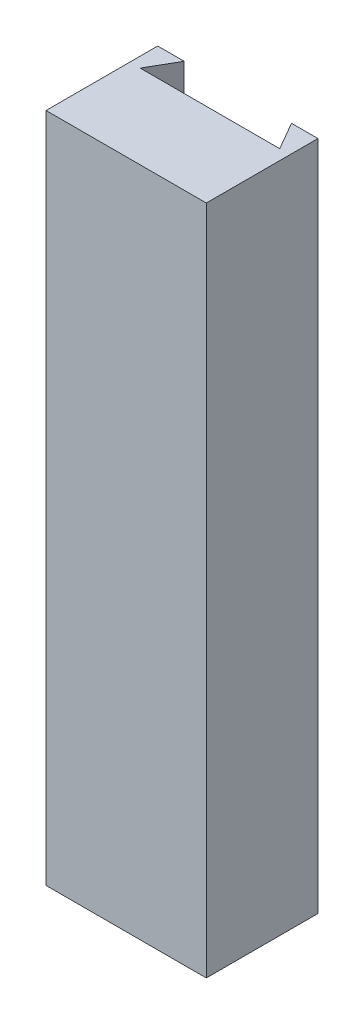
ISO-10303-21;
HEADER;
FILE_DESCRIPTION(('STEP AP214'),'2;1');
FILE_NAME('part.step','',(''),(''),'','','');
FILE_SCHEMA(('AUTOMOTIVE_DESIGN { 1 0 10303 214 1 1 1 1 }'));
ENDSEC;
DATA;
#1=APPLICATION_CONTEXT('core data for automotive mechanical design processes');
#2=APPLICATION_PROTOCOL_DEFINITION('international standard','automotive_design',2000,#1);
#3=PRODUCT_CONTEXT('',#1,'mechanical');
#4=PRODUCT('Part','Part','',(#3));
#5=PRODUCT_RELATED_PRODUCT_CATEGORY('part','',(#4));
#6=PRODUCT_DEFINITION_FORMATION('','',#4);
#7=PRODUCT_DEFINITION_CONTEXT('part definition',#1,'design');
#8=PRODUCT_DEFINITION('design','',#6,#7);
#9=PRODUCT_DEFINITION_SHAPE('','',#8);
#10=(LENGTH_UNIT() NAMED_UNIT(*) SI_UNIT(.MILLI.,.METRE.));
#11=(NAMED_UNIT(*) PLANE_ANGLE_UNIT() SI_UNIT($,.RADIAN.));
#12=(NAMED_UNIT(*) SI_UNIT($,.STERADIAN.) SOLID_ANGLE_UNIT());
#13=UNCERTAINTY_MEASURE_WITH_UNIT(LENGTH_MEASURE(1.E-05),#10,'distance_accuracy_value','');
#14=(GEOMETRIC_REPRESENTATION_CONTEXT(3) GLOBAL_UNCERTAINTY_ASSIGNED_CONTEXT((#13)) GLOBAL_UNIT_ASSIGNED_CONTEXT((#10,
#11,#12)) REPRESENTATION_CONTEXT('',''));
#15=CARTESIAN_POINT('',(0.,0.,0.));
#16=DIRECTION('',(0.,0.,1.));
#17=DIRECTION('',(1.,0.,0.));
#18=AXIS2_PLACEMENT_3D('',#15,#16,#17);
#19=CARTESIAN_POINT('',(0.,0.,0.));
#20=DIRECTION('',(0.,0.,-1.));
#21=DIRECTION('',(-1.,0.,0.));
#22=AXIS2_PLACEMENT_3D('',#19,#20,#21);
#23=PLANE('',#22);
#24=DIRECTION('',(0.,-1.,0.));
#25=VECTOR('',#24,1.);
#26=CARTESIAN_POINT('',(-0.961324865405189,12.021,0.));
#27=LINE('',#26,#25);
#28=CARTESIAN_POINT('',(-0.961324865405188,12.02,0.));
#29=VERTEX_POINT('',#28);
#30=CARTESIAN_POINT('',(-0.961324865405187,0.,0.));
#31=VERTEX_POINT('',#30);
#32=EDGE_CURVE('E110',#29,#31,#27,.T.);
#33=ORIENTED_EDGE('',*,*,#32,.T.);
#34=DIRECTION('',(1.,0.,0.));
#35=VECTOR('',#34,1.);
#36=CARTESIAN_POINT('',(-1.43499999999999,0.,0.));
#37=LINE('',#36,#35);
#38=CARTESIAN_POINT('',(-1.43499999999999,0.,0.));
#39=VERTEX_POINT('',#38);
#40=EDGE_CURVE('E124',#39,#31,#37,.T.);
#41=ORIENTED_EDGE('',*,*,#40,.F.);
#42=DIRECTION('',(0.,-1.,0.));
#43=VECTOR('',#42,1.);
#44=CARTESIAN_POINT('',(-1.43499999999999,0.,0.));
#45=LINE('',#44,#43);
#46=CARTESIAN_POINT('',(-1.435,12.02,0.));
#47=VERTEX_POINT('',#46);
#48=EDGE_CURVE('E136',#47,#39,#45,.T.);
#49=ORIENTED_EDGE('',*,*,#48,.F.);
#50=DIRECTION('',(-1.,0.,0.));
#51=VECTOR('',#50,1.);
#52=CARTESIAN_POINT('',(-1.435,12.02,0.));
#53=LINE('',#52,#51);
#54=EDGE_CURVE('E125',#29,#47,#53,.T.);
#55=ORIENTED_EDGE('',*,*,#54,.F.);
#56=EDGE_LOOP('',(#33,#41,#49,#55));
#57=FACE_BOUND('',#56,.T.);
#58=ADVANCED_FACE('F33',(#57),#23,.T.);
#59=CARTESIAN_POINT('',(1.43499999999999,0.,2.));
#60=DIRECTION('',(-1.,0.,0.));
#61=DIRECTION('',(0.,-1.,0.));
#62=AXIS2_PLACEMENT_3D('',#59,#60,#61);
#63=PLANE('',#62);
#64=DIRECTION('',(0.,1.,0.));
#65=VECTOR('',#64,1.);
#66=CARTESIAN_POINT('',(1.43499999999999,0.,0.));
#67=LINE('',#66,#65);
#68=CARTESIAN_POINT('',(1.43499999999999,0.,0.));
#69=VERTEX_POINT('',#68);
#70=CARTESIAN_POINT('',(1.435,12.02,0.));
#71=VERTEX_POINT('',#70);
#72=EDGE_CURVE('E149',#69,#71,#67,.T.);
#73=ORIENTED_EDGE('',*,*,#72,.T.);
#74=DIRECTION('',(0.,0.,-1.));
#75=VECTOR('',#74,1.);
#76=CARTESIAN_POINT('',(1.435,12.02,2.));
#77=LINE('',#76,#75);
#78=CARTESIAN_POINT('',(1.435,12.02,2.));
#79=VERTEX_POINT('',#78);
#80=EDGE_CURVE('E11',#79,#71,#77,.T.);
#81=ORIENTED_EDGE('',*,*,#80,.F.);
#82=DIRECTION('',(0.,1.,0.));
#83=VECTOR('',#82,1.);
#84=CARTESIAN_POINT('',(1.43499999999999,0.,2.));
#85=LINE('',#84,#83);
#86=CARTESIAN_POINT('',(1.43499999999999,0.,2.));
#87=VERTEX_POINT('',#86);
#88=EDGE_CURVE('E133',#87,#79,#85,.T.);
#89=ORIENTED_EDGE('',*,*,#88,.F.);
#90=DIRECTION('',(0.,0.,-1.));
#91=VECTOR('',#90,1.);
#92=CARTESIAN_POINT('',(1.43499999999999,0.,2.));
#93=LINE('',#92,#91);
#94=EDGE_CURVE('E140',#87,#69,#93,.T.);
#95=ORIENTED_EDGE('',*,*,#94,.T.);
#96=EDGE_LOOP('',(#73,#81,#89,#95));
#97=FACE_BOUND('',#96,.T.);
#98=ADVANCED_FACE('F35',(#97),#63,.F.);
#99=CARTESIAN_POINT('',(-1.435,12.02,2.));
#100=DIRECTION('',(0.,-1.,0.));
#101=DIRECTION('',(0.,0.,-1.));
#102=AXIS2_PLACEMENT_3D('',#99,#100,#101);
#103=PLANE('',#102);
#104=DIRECTION('',(1.,0.,0.));
#105=VECTOR('',#104,1.);
#106=CARTESIAN_POINT('',(1.25,12.02,0.5));
#107=LINE('',#106,#105);
#108=CARTESIAN_POINT('',(-1.25,12.02,0.5));
#109=VERTEX_POINT('',#108);
#110=CARTESIAN_POINT('',(1.25,12.02,0.5));
#111=VERTEX_POINT('',#110);
#112=EDGE_CURVE('E126',#109,#111,#107,.T.);
#113=ORIENTED_EDGE('',*,*,#112,.F.);
#114=DIRECTION('',(-0.5,0.,0.866025403784439));
#115=VECTOR('',#114,1.);
#116=CARTESIAN_POINT('',(-1.25,12.02,0.5));
#117=LINE('',#116,#115);
#118=EDGE_CURVE('E118',#29,#109,#117,.T.);
#119=ORIENTED_EDGE('',*,*,#118,.F.);
#120=ORIENTED_EDGE('',*,*,#54,.T.);
#121=DIRECTION('',(0.,0.,-1.));
#122=VECTOR('',#121,1.);
#123=CARTESIAN_POINT('',(-1.435,12.02,2.));
#124=LINE('',#123,#122);
#125=CARTESIAN_POINT('',(-1.435,12.02,2.));
#126=VERTEX_POINT('',#125);
#127=EDGE_CURVE('E41',#126,#47,#124,.T.);
#128=ORIENTED_EDGE('',*,*,#127,.F.);
#129=DIRECTION('',(-1.,0.,0.));
#130=VECTOR('',#129,1.);
#131=CARTESIAN_POINT('',(-1.435,12.02,2.));
#132=LINE('',#131,#130);
#133=EDGE_CURVE('E85',#79,#126,#132,.T.);
#134=ORIENTED_EDGE('',*,*,#133,.F.);
#135=ORIENTED_EDGE('',*,*,#80,.T.);
#136=CARTESIAN_POINT('',(0.961324865405186,12.02,0.));
#137=VERTEX_POINT('',#136);
#138=EDGE_CURVE('E147',#71,#137,#53,.T.);
#139=ORIENTED_EDGE('',*,*,#138,.T.);
#140=DIRECTION('',(-0.5,0.,-0.866025403784439));
#141=VECTOR('',#140,1.);
#142=CARTESIAN_POINT('',(0.,12.02,-1.6650635094611));
#143=LINE('',#142,#141);
#144=EDGE_CURVE('E48',#111,#137,#143,.T.);
#145=ORIENTED_EDGE('',*,*,#144,.F.);
#146=EDGE_LOOP('',(#113,#119,#120,#128,#134,#135,#139,#145));
#147=FACE_BOUND('',#146,.T.);
#148=ADVANCED_FACE('F173',(#147),#103,.F.);
#149=CARTESIAN_POINT('',(-1.43499999999999,0.,2.));
#150=DIRECTION('',(1.,0.,0.));
#151=DIRECTION('',(0.,1.,0.));
#152=AXIS2_PLACEMENT_3D('',#149,#150,#151);
#153=PLANE('',#152);
#154=ORIENTED_EDGE('',*,*,#48,.T.);
#155=DIRECTION('',(0.,0.,-1.));
#156=VECTOR('',#155,1.);
#157=CARTESIAN_POINT('',(-1.43499999999999,0.,2.));
#158=LINE('',#157,#156);
#159=CARTESIAN_POINT('',(-1.43499999999999,0.,2.));
#160=VERTEX_POINT('',#159);
#161=EDGE_CURVE('E132',#160,#39,#158,.T.);
#162=ORIENTED_EDGE('',*,*,#161,.F.);
#163=DIRECTION('',(0.,-1.,0.));
#164=VECTOR('',#163,1.);
#165=CARTESIAN_POINT('',(-1.43499999999999,0.,2.));
#166=LINE('',#165,#164);
#167=EDGE_CURVE('E146',#126,#160,#166,.T.);
#168=ORIENTED_EDGE('',*,*,#167,.F.);
#169=ORIENTED_EDGE('',*,*,#127,.T.);
#170=EDGE_LOOP('',(#154,#162,#168,#169));
#171=FACE_BOUND('',#170,.T.);
#172=ADVANCED_FACE('F145',(#171),#153,.F.);
#173=CARTESIAN_POINT('',(-1.43499999999999,0.,2.));
#174=DIRECTION('',(0.,1.,0.));
#175=DIRECTION('',(-1.,0.,0.));
#176=AXIS2_PLACEMENT_3D('',#173,#174,#175);
#177=PLANE('',#176);
#178=ORIENTED_EDGE('',*,*,#40,.T.);
#179=DIRECTION('',(0.5,0.,-0.866025403784438));
#180=VECTOR('',#179,1.);
#181=CARTESIAN_POINT('',(-1.25,0.,0.5));
#182=LINE('',#181,#180);
#183=CARTESIAN_POINT('',(-1.25,0.,0.5));
#184=VERTEX_POINT('',#183);
#185=EDGE_CURVE('E107',#184,#31,#182,.T.);
#186=ORIENTED_EDGE('',*,*,#185,.F.);
#187=DIRECTION('',(-1.,0.,0.));
#188=VECTOR('',#187,1.);
#189=CARTESIAN_POINT('',(1.25,0.,0.5));
#190=LINE('',#189,#188);
#191=CARTESIAN_POINT('',(1.25,0.,0.5));
#192=VERTEX_POINT('',#191);
#193=EDGE_CURVE('E159',#192,#184,#190,.T.);
#194=ORIENTED_EDGE('',*,*,#193,.F.);
#195=DIRECTION('',(0.5,0.,0.866025403784439));
#196=VECTOR('',#195,1.);
#197=CARTESIAN_POINT('',(0.,0.,-1.6650635094611));
#198=LINE('',#197,#196);
#199=CARTESIAN_POINT('',(0.961324865405187,0.,0.));
#200=VERTEX_POINT('',#199);
#201=EDGE_CURVE('E117',#200,#192,#198,.T.);
#202=ORIENTED_EDGE('',*,*,#201,.F.);
#203=EDGE_CURVE('E78',#200,#69,#37,.T.);
#204=ORIENTED_EDGE('',*,*,#203,.T.);
#205=ORIENTED_EDGE('',*,*,#94,.F.);
#206=DIRECTION('',(1.,0.,0.));
#207=VECTOR('',#206,1.);
#208=CARTESIAN_POINT('',(-1.43499999999999,0.,2.));
#209=LINE('',#208,#207);
#210=EDGE_CURVE('E57',#160,#87,#209,.T.);
#211=ORIENTED_EDGE('',*,*,#210,.F.);
#212=ORIENTED_EDGE('',*,*,#161,.T.);
#213=EDGE_LOOP('',(#178,#186,#194,#202,#204,#205,#211,#212));
#214=FACE_BOUND('',#213,.T.);
#215=ADVANCED_FACE('F130',(#214),#177,.F.);
#216=CARTESIAN_POINT('',(0.,0.,2.));
#217=DIRECTION('',(0.,0.,-1.));
#218=DIRECTION('',(-1.,0.,0.));
#219=AXIS2_PLACEMENT_3D('',#216,#217,#218);
#220=PLANE('',#219);
#221=ORIENTED_EDGE('',*,*,#88,.T.);
#222=ORIENTED_EDGE('',*,*,#133,.T.);
#223=ORIENTED_EDGE('',*,*,#167,.T.);
#224=ORIENTED_EDGE('',*,*,#210,.T.);
#225=EDGE_LOOP('',(#221,#222,#223,#224));
#226=FACE_BOUND('',#225,.T.);
#227=ADVANCED_FACE('F188',(#226),#220,.F.);
#228=DIRECTION('',(0.,1.,0.));
#229=VECTOR('',#228,1.);
#230=CARTESIAN_POINT('',(0.961324865405185,12.021,0.));
#231=LINE('',#230,#229);
#232=EDGE_CURVE('E127',#200,#137,#231,.T.);
#233=ORIENTED_EDGE('',*,*,#232,.T.);
#234=ORIENTED_EDGE('',*,*,#138,.F.);
#235=ORIENTED_EDGE('',*,*,#72,.F.);
#236=ORIENTED_EDGE('',*,*,#203,.F.);
#237=EDGE_LOOP('',(#233,#234,#235,#236));
#238=FACE_BOUND('',#237,.T.);
#239=ADVANCED_FACE('F167',(#238),#23,.T.);
#240=CARTESIAN_POINT('',(-1.25,12.021,0.5));
#241=DIRECTION('',(-0.866025403784438,0.,-0.5));
#242=DIRECTION('',(-0.5,0.,0.866025403784439));
#243=AXIS2_PLACEMENT_3D('',#240,#241,#242);
#244=PLANE('',#243);
#245=ORIENTED_EDGE('',*,*,#118,.T.);
#246=DIRECTION('',(0.,-1.,0.));
#247=VECTOR('',#246,1.);
#248=CARTESIAN_POINT('',(-1.25,12.021,0.5));
#249=LINE('',#248,#247);
#250=EDGE_CURVE('E113',#109,#184,#249,.T.);
#251=ORIENTED_EDGE('',*,*,#250,.T.);
#252=ORIENTED_EDGE('',*,*,#185,.T.);
#253=ORIENTED_EDGE('',*,*,#32,.F.);
#254=EDGE_LOOP('',(#245,#251,#252,#253));
#255=FACE_BOUND('',#254,.T.);
#256=ADVANCED_FACE('F109',(#255),#244,.F.);
#257=CARTESIAN_POINT('',(1.25,12.021,0.5));
#258=DIRECTION('',(0.,0.,1.));
#259=DIRECTION('',(1.,0.,0.));
#260=AXIS2_PLACEMENT_3D('',#257,#258,#259);
#261=PLANE('',#260);
#262=ORIENTED_EDGE('',*,*,#112,.T.);
#263=DIRECTION('',(0.,-1.,0.));
#264=VECTOR('',#263,1.);
#265=CARTESIAN_POINT('',(1.25,12.021,0.5));
#266=LINE('',#265,#264);
#267=EDGE_CURVE('E157',#111,#192,#266,.T.);
#268=ORIENTED_EDGE('',*,*,#267,.T.);
#269=ORIENTED_EDGE('',*,*,#193,.T.);
#270=ORIENTED_EDGE('',*,*,#250,.F.);
#271=EDGE_LOOP('',(#262,#268,#269,#270));
#272=FACE_BOUND('',#271,.T.);
#273=ADVANCED_FACE('F171',(#272),#261,.F.);
#274=CARTESIAN_POINT('',(0.,12.021,-1.6650635094611));
#275=DIRECTION('',(0.866025403784439,0.,-0.5));
#276=DIRECTION('',(-0.5,0.,-0.866025403784439));
#277=AXIS2_PLACEMENT_3D('',#274,#275,#276);
#278=PLANE('',#277);
#279=ORIENTED_EDGE('',*,*,#144,.T.);
#280=ORIENTED_EDGE('',*,*,#232,.F.);
#281=ORIENTED_EDGE('',*,*,#201,.T.);
#282=ORIENTED_EDGE('',*,*,#267,.F.);
#283=EDGE_LOOP('',(#279,#280,#281,#282));
#284=FACE_BOUND('',#283,.T.);
#285=ADVANCED_FACE('F169',(#284),#278,.F.);
#286=CLOSED_SHELL('',(#58,#98,#148,#172,#215,#227,#239,#256,#273,#285));
#287=MANIFOLD_SOLID_BREP('B2',#286);
#288=ADVANCED_BREP_SHAPE_REPRESENTATION('',(#18,#287),#14);
#289=SHAPE_DEFINITION_REPRESENTATION(#9,#288);
ENDSEC;
END-ISO-10303-21;
